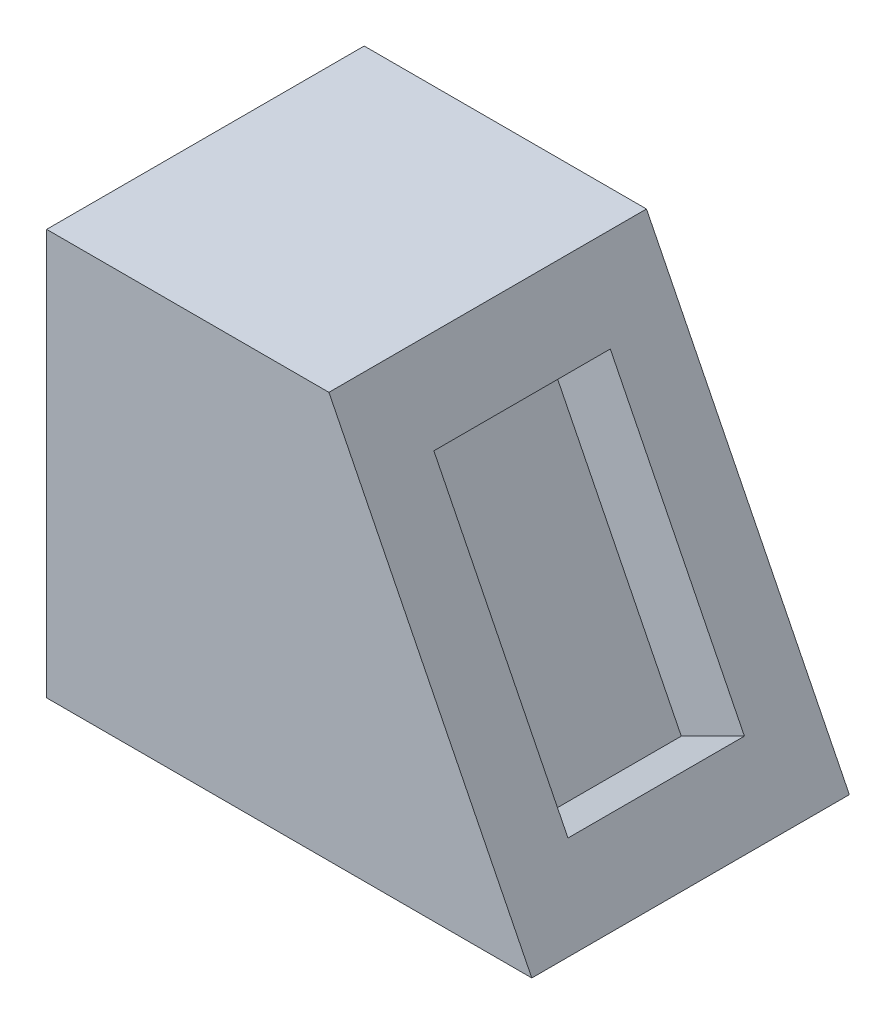
ISO-10303-21;
HEADER;
FILE_DESCRIPTION(('STEP AP214'),'2;1');
FILE_NAME('part.step','',(''),(''),'','','');
FILE_SCHEMA(('AUTOMOTIVE_DESIGN { 1 0 10303 214 1 1 1 1 }'));
ENDSEC;
DATA;
#1=APPLICATION_CONTEXT('core data for automotive mechanical design processes');
#2=APPLICATION_PROTOCOL_DEFINITION('international standard','automotive_design',2000,#1);
#3=PRODUCT_CONTEXT('',#1,'mechanical');
#4=PRODUCT('Part','Part','',(#3));
#5=PRODUCT_RELATED_PRODUCT_CATEGORY('part','',(#4));
#6=PRODUCT_DEFINITION_FORMATION('','',#4);
#7=PRODUCT_DEFINITION_CONTEXT('part definition',#1,'design');
#8=PRODUCT_DEFINITION('design','',#6,#7);
#9=PRODUCT_DEFINITION_SHAPE('','',#8);
#10=(LENGTH_UNIT() NAMED_UNIT(*) SI_UNIT(.MILLI.,.METRE.));
#11=(NAMED_UNIT(*) PLANE_ANGLE_UNIT() SI_UNIT($,.RADIAN.));
#12=(NAMED_UNIT(*) SI_UNIT($,.STERADIAN.) SOLID_ANGLE_UNIT());
#13=UNCERTAINTY_MEASURE_WITH_UNIT(LENGTH_MEASURE(1.E-05),#10,'distance_accuracy_value','');
#14=(GEOMETRIC_REPRESENTATION_CONTEXT(3) GLOBAL_UNCERTAINTY_ASSIGNED_CONTEXT((#13)) GLOBAL_UNIT_ASSIGNED_CONTEXT((#10,
#11,#12)) REPRESENTATION_CONTEXT('',''));
#15=CARTESIAN_POINT('',(0.,0.,0.));
#16=DIRECTION('',(0.,0.,1.));
#17=DIRECTION('',(1.,0.,0.));
#18=AXIS2_PLACEMENT_3D('',#15,#16,#17);
#19=CARTESIAN_POINT('',(0.,0.,-180.));
#20=DIRECTION('',(-1.,0.,0.));
#21=DIRECTION('',(0.,0.,1.));
#22=AXIS2_PLACEMENT_3D('',#19,#20,#21);
#23=PLANE('',#22);
#24=DIRECTION('',(0.,-1.,0.));
#25=VECTOR('',#24,1.);
#26=CARTESIAN_POINT('',(0.,0.,0.));
#27=LINE('',#26,#25);
#28=CARTESIAN_POINT('',(0.,230.,0.));
#29=VERTEX_POINT('',#28);
#30=CARTESIAN_POINT('',(0.,0.,0.));
#31=VERTEX_POINT('',#30);
#32=EDGE_CURVE('E131',#29,#31,#27,.T.);
#33=ORIENTED_EDGE('',*,*,#32,.F.);
#34=DIRECTION('',(0.,0.,1.));
#35=VECTOR('',#34,1.);
#36=CARTESIAN_POINT('',(0.,230.,-180.));
#37=LINE('',#36,#35);
#38=CARTESIAN_POINT('',(0.,230.,-180.));
#39=VERTEX_POINT('',#38);
#40=EDGE_CURVE('E55',#39,#29,#37,.T.);
#41=ORIENTED_EDGE('',*,*,#40,.F.);
#42=DIRECTION('',(0.,-1.,0.));
#43=VECTOR('',#42,1.);
#44=CARTESIAN_POINT('',(0.,0.,-180.));
#45=LINE('',#44,#43);
#46=CARTESIAN_POINT('',(0.,0.,-180.));
#47=VERTEX_POINT('',#46);
#48=EDGE_CURVE('E136',#39,#47,#45,.T.);
#49=ORIENTED_EDGE('',*,*,#48,.T.);
#50=DIRECTION('',(0.,0.,1.));
#51=VECTOR('',#50,1.);
#52=CARTESIAN_POINT('',(0.,0.,-180.));
#53=LINE('',#52,#51);
#54=EDGE_CURVE('E81',#47,#31,#53,.T.);
#55=ORIENTED_EDGE('',*,*,#54,.T.);
#56=EDGE_LOOP('',(#33,#41,#49,#55));
#57=FACE_BOUND('',#56,.T.);
#58=ADVANCED_FACE('F33',(#57),#23,.T.);
#59=CARTESIAN_POINT('',(0.,230.,-180.));
#60=DIRECTION('',(0.,1.,0.));
#61=DIRECTION('',(0.,0.,1.));
#62=AXIS2_PLACEMENT_3D('',#59,#60,#61);
#63=PLANE('',#62);
#64=DIRECTION('',(-1.,0.,0.));
#65=VECTOR('',#64,1.);
#66=CARTESIAN_POINT('',(0.,230.,0.));
#67=LINE('',#66,#65);
#68=CARTESIAN_POINT('',(160.,230.,0.));
#69=VERTEX_POINT('',#68);
#70=EDGE_CURVE('E139',#69,#29,#67,.T.);
#71=ORIENTED_EDGE('',*,*,#70,.F.);
#72=DIRECTION('',(0.,0.,1.));
#73=VECTOR('',#72,1.);
#74=CARTESIAN_POINT('',(160.,230.,-180.));
#75=LINE('',#74,#73);
#76=CARTESIAN_POINT('',(160.,230.,-180.));
#77=VERTEX_POINT('',#76);
#78=EDGE_CURVE('E158',#77,#69,#75,.T.);
#79=ORIENTED_EDGE('',*,*,#78,.F.);
#80=DIRECTION('',(-1.,0.,0.));
#81=VECTOR('',#80,1.);
#82=CARTESIAN_POINT('',(0.,230.,-180.));
#83=LINE('',#82,#81);
#84=EDGE_CURVE('E144',#77,#39,#83,.T.);
#85=ORIENTED_EDGE('',*,*,#84,.T.);
#86=ORIENTED_EDGE('',*,*,#40,.T.);
#87=EDGE_LOOP('',(#71,#79,#85,#86));
#88=FACE_BOUND('',#87,.T.);
#89=ADVANCED_FACE('F183',(#88),#63,.T.);
#90=CARTESIAN_POINT('',(160.,230.,-180.));
#91=DIRECTION('',(0.894427190999916,0.447213595499958,0.));
#92=DIRECTION('',(-0.447213595499958,0.894427190999916,0.));
#93=AXIS2_PLACEMENT_3D('',#90,#91,#92);
#94=PLANE('',#93);
#95=DIRECTION('',(0.,0.,-1.));
#96=VECTOR('',#95,1.);
#97=CARTESIAN_POINT('',(255.513155617496,38.9736887650071,-180.));
#98=LINE('',#97,#96);
#99=CARTESIAN_POINT('',(255.513155617496,38.9736887650071,-40.));
#100=VERTEX_POINT('',#99);
#101=CARTESIAN_POINT('',(255.513155617496,38.9736887650072,-140.));
#102=VERTEX_POINT('',#101);
#103=EDGE_CURVE('E11',#100,#102,#98,.T.);
#104=ORIENTED_EDGE('',*,*,#103,.F.);
#105=DIRECTION('',(0.447213595499958,-0.894427190999916,0.));
#106=VECTOR('',#105,1.);
#107=CARTESIAN_POINT('',(160.,230.,-40.));
#108=LINE('',#107,#106);
#109=CARTESIAN_POINT('',(179.486844382504,191.026311234993,-40.));
#110=VERTEX_POINT('',#109);
#111=EDGE_CURVE('E40',#110,#100,#108,.T.);
#112=ORIENTED_EDGE('',*,*,#111,.F.);
#113=DIRECTION('',(0.,0.,1.));
#114=VECTOR('',#113,1.);
#115=CARTESIAN_POINT('',(179.486844382504,191.026311234993,-180.));
#116=LINE('',#115,#114);
#117=CARTESIAN_POINT('',(179.486844382504,191.026311234993,-140.));
#118=VERTEX_POINT('',#117);
#119=EDGE_CURVE('E164',#118,#110,#116,.T.);
#120=ORIENTED_EDGE('',*,*,#119,.F.);
#121=DIRECTION('',(-0.447213595499958,0.894427190999916,0.));
#122=VECTOR('',#121,1.);
#123=CARTESIAN_POINT('',(160.,230.,-140.));
#124=LINE('',#123,#122);
#125=EDGE_CURVE('E157',#102,#118,#124,.T.);
#126=ORIENTED_EDGE('',*,*,#125,.F.);
#127=EDGE_LOOP('',(#104,#112,#120,#126));
#128=FACE_BOUND('',#127,.T.);
#129=DIRECTION('',(-0.447213595499958,0.894427190999916,0.));
#130=VECTOR('',#129,1.);
#131=CARTESIAN_POINT('',(160.,230.,0.));
#132=LINE('',#131,#130);
#133=CARTESIAN_POINT('',(275.,0.,0.));
#134=VERTEX_POINT('',#133);
#135=EDGE_CURVE('E151',#134,#69,#132,.T.);
#136=ORIENTED_EDGE('',*,*,#135,.F.);
#137=DIRECTION('',(0.,0.,1.));
#138=VECTOR('',#137,1.);
#139=CARTESIAN_POINT('',(275.,0.,-180.));
#140=LINE('',#139,#138);
#141=CARTESIAN_POINT('',(275.,0.,-180.));
#142=VERTEX_POINT('',#141);
#143=EDGE_CURVE('E160',#142,#134,#140,.T.);
#144=ORIENTED_EDGE('',*,*,#143,.F.);
#145=DIRECTION('',(-0.447213595499958,0.894427190999916,0.));
#146=VECTOR('',#145,1.);
#147=CARTESIAN_POINT('',(160.,230.,-180.));
#148=LINE('',#147,#146);
#149=EDGE_CURVE('E141',#142,#77,#148,.T.);
#150=ORIENTED_EDGE('',*,*,#149,.T.);
#151=ORIENTED_EDGE('',*,*,#78,.T.);
#152=EDGE_LOOP('',(#136,#144,#150,#151));
#153=FACE_BOUND('',#152,.T.);
#154=ADVANCED_FACE('F170',(#128,#153),#94,.T.);
#155=CARTESIAN_POINT('',(0.,0.,-180.));
#156=DIRECTION('',(0.,-1.,0.));
#157=DIRECTION('',(0.,0.,-1.));
#158=AXIS2_PLACEMENT_3D('',#155,#156,#157);
#159=PLANE('',#158);
#160=DIRECTION('',(1.,0.,0.));
#161=VECTOR('',#160,1.);
#162=CARTESIAN_POINT('',(0.,0.,0.));
#163=LINE('',#162,#161);
#164=EDGE_CURVE('E148',#31,#134,#163,.T.);
#165=ORIENTED_EDGE('',*,*,#164,.F.);
#166=ORIENTED_EDGE('',*,*,#54,.F.);
#167=DIRECTION('',(1.,0.,0.));
#168=VECTOR('',#167,1.);
#169=CARTESIAN_POINT('',(0.,0.,-180.));
#170=LINE('',#169,#168);
#171=EDGE_CURVE('E138',#47,#142,#170,.T.);
#172=ORIENTED_EDGE('',*,*,#171,.T.);
#173=ORIENTED_EDGE('',*,*,#143,.T.);
#174=EDGE_LOOP('',(#165,#166,#172,#173));
#175=FACE_BOUND('',#174,.T.);
#176=ADVANCED_FACE('F195',(#175),#159,.T.);
#177=CARTESIAN_POINT('',(0.,0.,-180.));
#178=DIRECTION('',(0.,0.,-1.));
#179=DIRECTION('',(-1.,0.,0.));
#180=AXIS2_PLACEMENT_3D('',#177,#178,#179);
#181=PLANE('',#180);
#182=ORIENTED_EDGE('',*,*,#48,.F.);
#183=ORIENTED_EDGE('',*,*,#84,.F.);
#184=ORIENTED_EDGE('',*,*,#149,.F.);
#185=ORIENTED_EDGE('',*,*,#171,.F.);
#186=EDGE_LOOP('',(#182,#183,#184,#185));
#187=FACE_BOUND('',#186,.T.);
#188=ADVANCED_FACE('F194',(#187),#181,.T.);
#189=CARTESIAN_POINT('',(0.,0.,0.));
#190=DIRECTION('',(0.,0.,-1.));
#191=DIRECTION('',(-1.,0.,0.));
#192=AXIS2_PLACEMENT_3D('',#189,#190,#191);
#193=PLANE('',#192);
#194=ORIENTED_EDGE('',*,*,#32,.T.);
#195=ORIENTED_EDGE('',*,*,#164,.T.);
#196=ORIENTED_EDGE('',*,*,#135,.T.);
#197=ORIENTED_EDGE('',*,*,#70,.T.);
#198=EDGE_LOOP('',(#194,#195,#196,#197));
#199=FACE_BOUND('',#198,.T.);
#200=ADVANCED_FACE('F189',(#199),#193,.F.);
#201=CARTESIAN_POINT('',(219.7360679775,21.0851449450088,-140.));
#202=DIRECTION('',(0.447213595499958,-0.894427190999916,0.));
#203=DIRECTION('',(0.894427190999916,0.447213595499958,0.));
#204=AXIS2_PLACEMENT_3D('',#201,#202,#203);
#205=PLANE('',#204);
#206=ORIENTED_EDGE('',*,*,#103,.T.);
#207=DIRECTION('',(0.894427190999916,0.447213595499958,0.));
#208=VECTOR('',#207,1.);
#209=CARTESIAN_POINT('',(219.7360679775,21.0851449450088,-140.));
#210=LINE('',#209,#208);
#211=CARTESIAN_POINT('',(219.7360679775,21.0851449450088,-140.));
#212=VERTEX_POINT('',#211);
#213=EDGE_CURVE('E47',#212,#102,#210,.T.);
#214=ORIENTED_EDGE('',*,*,#213,.F.);
#215=DIRECTION('',(0.,0.,-1.));
#216=VECTOR('',#215,1.);
#217=CARTESIAN_POINT('',(219.7360679775,21.0851449450088,-140.));
#218=LINE('',#217,#216);
#219=CARTESIAN_POINT('',(219.7360679775,21.0851449450088,-40.));
#220=VERTEX_POINT('',#219);
#221=EDGE_CURVE('E107',#220,#212,#218,.T.);
#222=ORIENTED_EDGE('',*,*,#221,.F.);
#223=DIRECTION('',(0.894427190999916,0.447213595499958,0.));
#224=VECTOR('',#223,1.);
#225=CARTESIAN_POINT('',(219.7360679775,21.0851449450088,-40.));
#226=LINE('',#225,#224);
#227=EDGE_CURVE('E129',#220,#100,#226,.T.);
#228=ORIENTED_EDGE('',*,*,#227,.T.);
#229=EDGE_LOOP('',(#206,#214,#222,#228));
#230=FACE_BOUND('',#229,.T.);
#231=ADVANCED_FACE('F104',(#230),#205,.F.);
#232=CARTESIAN_POINT('',(219.7360679775,21.0851449450088,-40.));
#233=DIRECTION('',(0.,0.,1.));
#234=DIRECTION('',(0.,-1.,0.));
#235=AXIS2_PLACEMENT_3D('',#232,#233,#234);
#236=PLANE('',#235);
#237=ORIENTED_EDGE('',*,*,#111,.T.);
#238=ORIENTED_EDGE('',*,*,#227,.F.);
#239=DIRECTION('',(0.447213595499958,-0.894427190999916,0.));
#240=VECTOR('',#239,1.);
#241=CARTESIAN_POINT('',(219.7360679775,21.0851449450088,-40.));
#242=LINE('',#241,#240);
#243=CARTESIAN_POINT('',(143.709756742507,173.137767414995,-40.));
#244=VERTEX_POINT('',#243);
#245=EDGE_CURVE('E112',#244,#220,#242,.T.);
#246=ORIENTED_EDGE('',*,*,#245,.F.);
#247=DIRECTION('',(0.894427190999916,0.447213595499958,0.));
#248=VECTOR('',#247,1.);
#249=CARTESIAN_POINT('',(143.709756742507,173.137767414995,-40.));
#250=LINE('',#249,#248);
#251=EDGE_CURVE('E132',#244,#110,#250,.T.);
#252=ORIENTED_EDGE('',*,*,#251,.T.);
#253=EDGE_LOOP('',(#237,#238,#246,#252));
#254=FACE_BOUND('',#253,.T.);
#255=ADVANCED_FACE('F167',(#254),#236,.F.);
#256=CARTESIAN_POINT('',(143.709756742507,173.137767414995,-40.));
#257=DIRECTION('',(-0.447213595499958,0.894427190999916,0.));
#258=DIRECTION('',(-0.894427190999916,-0.447213595499958,0.));
#259=AXIS2_PLACEMENT_3D('',#256,#257,#258);
#260=PLANE('',#259);
#261=ORIENTED_EDGE('',*,*,#119,.T.);
#262=ORIENTED_EDGE('',*,*,#251,.F.);
#263=DIRECTION('',(0.,0.,1.));
#264=VECTOR('',#263,1.);
#265=CARTESIAN_POINT('',(143.709756742507,173.137767414995,-40.));
#266=LINE('',#265,#264);
#267=CARTESIAN_POINT('',(143.709756742507,173.137767414995,-140.));
#268=VERTEX_POINT('',#267);
#269=EDGE_CURVE('E121',#268,#244,#266,.T.);
#270=ORIENTED_EDGE('',*,*,#269,.F.);
#271=DIRECTION('',(0.894427190999916,0.447213595499958,0.));
#272=VECTOR('',#271,1.);
#273=CARTESIAN_POINT('',(143.709756742507,173.137767414995,-140.));
#274=LINE('',#273,#272);
#275=EDGE_CURVE('E111',#268,#118,#274,.T.);
#276=ORIENTED_EDGE('',*,*,#275,.T.);
#277=EDGE_LOOP('',(#261,#262,#270,#276));
#278=FACE_BOUND('',#277,.T.);
#279=ADVANCED_FACE('F173',(#278),#260,.F.);
#280=CARTESIAN_POINT('',(143.709756742507,173.137767414995,-140.));
#281=DIRECTION('',(0.,0.,-1.));
#282=DIRECTION('',(-1.,0.,0.));
#283=AXIS2_PLACEMENT_3D('',#280,#281,#282);
#284=PLANE('',#283);
#285=ORIENTED_EDGE('',*,*,#125,.T.);
#286=ORIENTED_EDGE('',*,*,#275,.F.);
#287=DIRECTION('',(-0.447213595499958,0.894427190999916,0.));
#288=VECTOR('',#287,1.);
#289=CARTESIAN_POINT('',(143.709756742507,173.137767414995,-140.));
#290=LINE('',#289,#288);
#291=EDGE_CURVE('E115',#212,#268,#290,.T.);
#292=ORIENTED_EDGE('',*,*,#291,.F.);
#293=ORIENTED_EDGE('',*,*,#213,.T.);
#294=EDGE_LOOP('',(#285,#286,#292,#293));
#295=FACE_BOUND('',#294,.T.);
#296=ADVANCED_FACE('F116',(#295),#284,.F.);
#297=CARTESIAN_POINT('',(184.222912360003,92.1114561800017,0.));
#298=DIRECTION('',(-0.894427190999916,-0.447213595499958,0.));
#299=DIRECTION('',(0.447213595499958,-0.894427190999916,0.));
#300=AXIS2_PLACEMENT_3D('',#297,#298,#299);
#301=PLANE('',#300);
#302=ORIENTED_EDGE('',*,*,#221,.T.);
#303=ORIENTED_EDGE('',*,*,#291,.T.);
#304=ORIENTED_EDGE('',*,*,#269,.T.);
#305=ORIENTED_EDGE('',*,*,#245,.T.);
#306=EDGE_LOOP('',(#302,#303,#304,#305));
#307=FACE_BOUND('',#306,.T.);
#308=ADVANCED_FACE('F123',(#307),#301,.F.);
#309=CLOSED_SHELL('',(#58,#89,#154,#176,#188,#200,#231,#255,#279,#296,#308));
#310=MANIFOLD_SOLID_BREP('B2',#309);
#311=ADVANCED_BREP_SHAPE_REPRESENTATION('',(#18,#310),#14);
#312=SHAPE_DEFINITION_REPRESENTATION(#9,#311);
ENDSEC;
END-ISO-10303-21;
